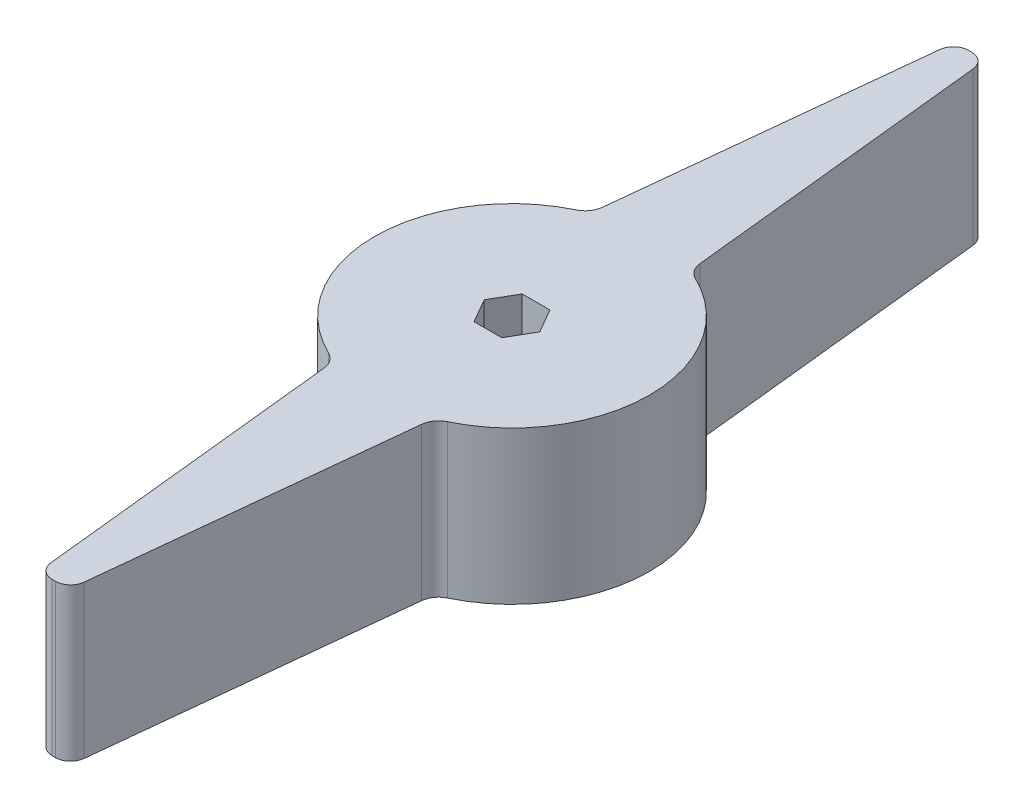
ISO-10303-21;
HEADER;
FILE_DESCRIPTION(('STEP AP214'),'2;1');
FILE_NAME('part.step','',(''),(''),'','','');
FILE_SCHEMA(('AUTOMOTIVE_DESIGN { 1 0 10303 214 1 1 1 1 }'));
ENDSEC;
DATA;
#1=APPLICATION_CONTEXT('core data for automotive mechanical design processes');
#2=APPLICATION_PROTOCOL_DEFINITION('international standard','automotive_design',2000,#1);
#3=PRODUCT_CONTEXT('',#1,'mechanical');
#4=PRODUCT('Part','Part','',(#3));
#5=PRODUCT_RELATED_PRODUCT_CATEGORY('part','',(#4));
#6=PRODUCT_DEFINITION_FORMATION('','',#4);
#7=PRODUCT_DEFINITION_CONTEXT('part definition',#1,'design');
#8=PRODUCT_DEFINITION('design','',#6,#7);
#9=PRODUCT_DEFINITION_SHAPE('','',#8);
#10=(LENGTH_UNIT() NAMED_UNIT(*) SI_UNIT(.MILLI.,.METRE.));
#11=(NAMED_UNIT(*) PLANE_ANGLE_UNIT() SI_UNIT($,.RADIAN.));
#12=(NAMED_UNIT(*) SI_UNIT($,.STERADIAN.) SOLID_ANGLE_UNIT());
#13=UNCERTAINTY_MEASURE_WITH_UNIT(LENGTH_MEASURE(1.E-05),#10,'distance_accuracy_value','');
#14=(GEOMETRIC_REPRESENTATION_CONTEXT(3) GLOBAL_UNCERTAINTY_ASSIGNED_CONTEXT((#13)) GLOBAL_UNIT_ASSIGNED_CONTEXT((#10,
#11,#12)) REPRESENTATION_CONTEXT('',''));
#15=CARTESIAN_POINT('',(0.,0.,0.));
#16=DIRECTION('',(0.,0.,1.));
#17=DIRECTION('',(1.,0.,0.));
#18=AXIS2_PLACEMENT_3D('',#15,#16,#17);
#19=CARTESIAN_POINT('',(0.124283579397994,-41.3802568542113,-36.8297903006777));
#20=DIRECTION('',(0.,1.,0.));
#21=DIRECTION('',(-1.,0.,0.));
#22=AXIS2_PLACEMENT_3D('',#19,#20,#21);
#23=CYLINDRICAL_SURFACE('',#22,1.27);
#24=CARTESIAN_POINT('',(0.124283579397994,-12.7,-36.8297903006777));
#25=DIRECTION('',(0.,-1.,0.));
#26=DIRECTION('',(1.,0.,0.));
#27=AXIS2_PLACEMENT_3D('',#24,#25,#26);
#28=CIRCLE('',#27,1.27);
#29=CARTESIAN_POINT('',(0.128569220066885,-12.7,-38.0997830696666));
#30=VERTEX_POINT('',#29);
#31=CARTESIAN_POINT('',(1.3873263865157,-12.7,-36.9625414490276));
#32=VERTEX_POINT('',#31);
#33=EDGE_CURVE('E11',#30,#32,#28,.T.);
#34=ORIENTED_EDGE('',*,*,#33,.F.);
#35=DIRECTION('',(0.,-1.,0.));
#36=VECTOR('',#35,1.);
#37=CARTESIAN_POINT('',(0.128569220066891,-3.33066907387547E-13,-38.0997830696666));
#38=LINE('',#37,#36);
#39=CARTESIAN_POINT('',(0.128569220066889,0.,-38.0997830696666));
#40=VERTEX_POINT('',#39);
#41=EDGE_CURVE('E24',#40,#30,#38,.T.);
#42=ORIENTED_EDGE('',*,*,#41,.F.);
#43=CARTESIAN_POINT('',(0.124283579397994,0.,-36.8297903006777));
#44=DIRECTION('',(0.,1.,0.));
#45=DIRECTION('',(1.,0.,0.));
#46=AXIS2_PLACEMENT_3D('',#43,#44,#45);
#47=CIRCLE('',#46,1.27);
#48=CARTESIAN_POINT('',(1.3873263865157,0.,-36.9625414490276));
#49=VERTEX_POINT('',#48);
#50=EDGE_CURVE('E432',#49,#40,#47,.T.);
#51=ORIENTED_EDGE('',*,*,#50,.F.);
#52=DIRECTION('',(0.,1.,0.));
#53=VECTOR('',#52,1.);
#54=CARTESIAN_POINT('',(1.3873263865157,0.,-36.9625414490276));
#55=LINE('',#54,#53);
#56=EDGE_CURVE('E427',#32,#49,#55,.T.);
#57=ORIENTED_EDGE('',*,*,#56,.F.);
#58=EDGE_LOOP('',(#34,#42,#51,#57));
#59=FACE_BOUND('',#58,.T.);
#60=ADVANCED_FACE('F16',(#59),#23,.T.);
#61=CARTESIAN_POINT('',(-0.124283579397992,-41.3802568542113,-36.8297903006777));
#62=DIRECTION('',(0.,1.,0.));
#63=DIRECTION('',(-1.,0.,0.));
#64=AXIS2_PLACEMENT_3D('',#61,#62,#63);
#65=CYLINDRICAL_SURFACE('',#64,1.27);
#66=CARTESIAN_POINT('',(-0.124283579397992,-12.7,-36.8297903006777));
#67=DIRECTION('',(0.,-1.,0.));
#68=DIRECTION('',(1.,0.,0.));
#69=AXIS2_PLACEMENT_3D('',#66,#67,#68);
#70=CIRCLE('',#69,1.27);
#71=CARTESIAN_POINT('',(-1.3873263865157,-12.7,-36.9625414490276));
#72=VERTEX_POINT('',#71);
#73=CARTESIAN_POINT('',(-0.128569220066888,-12.7,-38.0997830696666));
#74=VERTEX_POINT('',#73);
#75=EDGE_CURVE('E422',#72,#74,#70,.T.);
#76=ORIENTED_EDGE('',*,*,#75,.F.);
#77=DIRECTION('',(0.,-1.,0.));
#78=VECTOR('',#77,1.);
#79=CARTESIAN_POINT('',(-1.3873263865157,-41.3802568542113,-36.9625414490276));
#80=LINE('',#79,#78);
#81=CARTESIAN_POINT('',(-1.3873263865157,0.,-36.9625414490276));
#82=VERTEX_POINT('',#81);
#83=EDGE_CURVE('E417',#82,#72,#80,.T.);
#84=ORIENTED_EDGE('',*,*,#83,.F.);
#85=CARTESIAN_POINT('',(-0.124283579397992,0.,-36.8297903006777));
#86=DIRECTION('',(0.,1.,0.));
#87=DIRECTION('',(1.,0.,0.));
#88=AXIS2_PLACEMENT_3D('',#85,#86,#87);
#89=CIRCLE('',#88,1.27);
#90=CARTESIAN_POINT('',(-0.128569220066889,0.,-38.0997830696666));
#91=VERTEX_POINT('',#90);
#92=EDGE_CURVE('E414',#91,#82,#89,.T.);
#93=ORIENTED_EDGE('',*,*,#92,.F.);
#94=DIRECTION('',(0.,1.,0.));
#95=VECTOR('',#94,1.);
#96=CARTESIAN_POINT('',(-0.128569220066889,-3.33066907387547E-13,-38.0997830696666));
#97=LINE('',#96,#95);
#98=EDGE_CURVE('E409',#74,#91,#97,.T.);
#99=ORIENTED_EDGE('',*,*,#98,.F.);
#100=EDGE_LOOP('',(#76,#84,#93,#99));
#101=FACE_BOUND('',#100,.T.);
#102=ADVANCED_FACE('F447',(#101),#65,.T.);
#103=CARTESIAN_POINT('',(-5.63513554327944,-12.7,-11.7345879202837));
#104=DIRECTION('',(0.,1.,0.));
#105=DIRECTION('',(-1.,0.,0.));
#106=AXIS2_PLACEMENT_3D('',#103,#104,#105);
#107=CYLINDRICAL_SURFACE('',#106,1.5875);
#108=CARTESIAN_POINT('',(-5.63513554327944,-12.7,-11.7345879202837));
#109=DIRECTION('',(0.,1.,0.));
#110=DIRECTION('',(1.,0.,0.));
#111=AXIS2_PLACEMENT_3D('',#108,#109,#110);
#112=CIRCLE('',#111,1.5875);
#113=CARTESIAN_POINT('',(-4.94792389165999,-12.7,-10.3035406129321));
#114=VERTEX_POINT('',#113);
#115=CARTESIAN_POINT('',(-4.05633203438231,-12.7,-11.5686489848463));
#116=VERTEX_POINT('',#115);
#117=EDGE_CURVE('E404',#114,#116,#112,.T.);
#118=ORIENTED_EDGE('',*,*,#117,.F.);
#119=DIRECTION('',(0.,-1.,0.));
#120=VECTOR('',#119,1.);
#121=CARTESIAN_POINT('',(-4.94792389165999,-12.7,-10.3035406129321));
#122=LINE('',#121,#120);
#123=CARTESIAN_POINT('',(-4.94792389165999,0.,-10.3035406129321));
#124=VERTEX_POINT('',#123);
#125=EDGE_CURVE('E399',#124,#114,#122,.T.);
#126=ORIENTED_EDGE('',*,*,#125,.F.);
#127=CARTESIAN_POINT('',(-5.63513554327944,0.,-11.7345879202837));
#128=DIRECTION('',(0.,-1.,0.));
#129=DIRECTION('',(1.,0.,0.));
#130=AXIS2_PLACEMENT_3D('',#127,#128,#129);
#131=CIRCLE('',#130,1.5875);
#132=CARTESIAN_POINT('',(-4.05633203438231,0.,-11.5686489848463));
#133=VERTEX_POINT('',#132);
#134=EDGE_CURVE('E394',#133,#124,#131,.T.);
#135=ORIENTED_EDGE('',*,*,#134,.F.);
#136=DIRECTION('',(0.,1.,0.));
#137=VECTOR('',#136,1.);
#138=CARTESIAN_POINT('',(-4.05633203438231,0.,-11.5686489848463));
#139=LINE('',#138,#137);
#140=EDGE_CURVE('E389',#116,#133,#139,.T.);
#141=ORIENTED_EDGE('',*,*,#140,.F.);
#142=EDGE_LOOP('',(#118,#126,#135,#141));
#143=FACE_BOUND('',#142,.T.);
#144=ADVANCED_FACE('F487',(#143),#107,.F.);
#145=CARTESIAN_POINT('',(5.63513554327944,-12.7,-11.7345879202837));
#146=DIRECTION('',(0.,1.,0.));
#147=DIRECTION('',(-1.,0.,0.));
#148=AXIS2_PLACEMENT_3D('',#145,#146,#147);
#149=CYLINDRICAL_SURFACE('',#148,1.5875);
#150=CARTESIAN_POINT('',(5.63513554327944,-12.7,-11.7345879202837));
#151=DIRECTION('',(0.,1.,0.));
#152=DIRECTION('',(1.,0.,0.));
#153=AXIS2_PLACEMENT_3D('',#150,#151,#152);
#154=CIRCLE('',#153,1.5875);
#155=CARTESIAN_POINT('',(4.05633203438231,-12.7,-11.5686489848463));
#156=VERTEX_POINT('',#155);
#157=CARTESIAN_POINT('',(4.94792389165999,-12.7,-10.3035406129321));
#158=VERTEX_POINT('',#157);
#159=EDGE_CURVE('E384',#156,#158,#154,.T.);
#160=ORIENTED_EDGE('',*,*,#159,.F.);
#161=DIRECTION('',(0.,-1.,0.));
#162=VECTOR('',#161,1.);
#163=CARTESIAN_POINT('',(4.05633203438231,-41.3802568542113,-11.5686489848463));
#164=LINE('',#163,#162);
#165=CARTESIAN_POINT('',(4.05633203438231,0.,-11.5686489848463));
#166=VERTEX_POINT('',#165);
#167=EDGE_CURVE('E379',#166,#156,#164,.T.);
#168=ORIENTED_EDGE('',*,*,#167,.F.);
#169=CARTESIAN_POINT('',(5.63513554327944,0.,-11.7345879202837));
#170=DIRECTION('',(0.,-1.,0.));
#171=DIRECTION('',(1.,0.,0.));
#172=AXIS2_PLACEMENT_3D('',#169,#170,#171);
#173=CIRCLE('',#172,1.5875);
#174=CARTESIAN_POINT('',(4.94792389165999,0.,-10.3035406129321));
#175=VERTEX_POINT('',#174);
#176=EDGE_CURVE('E374',#175,#166,#173,.T.);
#177=ORIENTED_EDGE('',*,*,#176,.F.);
#178=DIRECTION('',(0.,1.,0.));
#179=VECTOR('',#178,1.);
#180=CARTESIAN_POINT('',(4.94792389165999,-12.7,-10.3035406129321));
#181=LINE('',#180,#179);
#182=EDGE_CURVE('E369',#158,#175,#181,.T.);
#183=ORIENTED_EDGE('',*,*,#182,.F.);
#184=EDGE_LOOP('',(#160,#168,#177,#183));
#185=FACE_BOUND('',#184,.T.);
#186=ADVANCED_FACE('F489',(#185),#149,.F.);
#187=CARTESIAN_POINT('',(-5.2146404262548,-41.3802568542113,-0.548080794186993));
#188=DIRECTION('',(0.994521895368273,0.,0.104528463267654));
#189=DIRECTION('',(-0.104528463267654,0.,0.994521895368273));
#190=AXIS2_PLACEMENT_3D('',#187,#188,#189);
#191=PLANE('',#190);
#192=DIRECTION('',(0.104528463267654,0.,-0.994521895368273));
#193=VECTOR('',#192,1.);
#194=CARTESIAN_POINT('',(-5.2146404262548,0.,-0.548080794186993));
#195=LINE('',#194,#193);
#196=EDGE_CURVE('E364',#133,#82,#195,.T.);
#197=ORIENTED_EDGE('',*,*,#196,.T.);
#198=ORIENTED_EDGE('',*,*,#83,.T.);
#199=DIRECTION('',(0.104528463267654,0.,-0.994521895368273));
#200=VECTOR('',#199,1.);
#201=CARTESIAN_POINT('',(-5.2146404262548,-12.7,-0.548080794186993));
#202=LINE('',#201,#200);
#203=EDGE_CURVE('E361',#116,#72,#202,.T.);
#204=ORIENTED_EDGE('',*,*,#203,.F.);
#205=ORIENTED_EDGE('',*,*,#140,.T.);
#206=EDGE_LOOP('',(#197,#198,#204,#205));
#207=FACE_BOUND('',#206,.T.);
#208=ADVANCED_FACE('F449',(#207),#191,.F.);
#209=CARTESIAN_POINT('',(0.,-41.3802568542113,0.));
#210=DIRECTION('',(0.,1.,0.));
#211=DIRECTION('',(-1.,0.,0.));
#212=AXIS2_PLACEMENT_3D('',#209,#210,#211);
#213=CYLINDRICAL_SURFACE('',#212,38.1);
#214=CARTESIAN_POINT('',(0.,-12.7,0.));
#215=DIRECTION('',(0.,-1.,0.));
#216=DIRECTION('',(1.,0.,0.));
#217=AXIS2_PLACEMENT_3D('',#214,#215,#216);
#218=CIRCLE('',#217,38.1);
#219=EDGE_CURVE('E358',#74,#30,#218,.T.);
#220=ORIENTED_EDGE('',*,*,#219,.F.);
#221=ORIENTED_EDGE('',*,*,#98,.T.);
#222=CARTESIAN_POINT('',(0.,0.,0.));
#223=DIRECTION('',(0.,-1.,0.));
#224=DIRECTION('',(1.,0.,0.));
#225=AXIS2_PLACEMENT_3D('',#222,#223,#224);
#226=CIRCLE('',#225,38.1);
#227=EDGE_CURVE('E354',#91,#40,#226,.T.);
#228=ORIENTED_EDGE('',*,*,#227,.T.);
#229=ORIENTED_EDGE('',*,*,#41,.T.);
#230=EDGE_LOOP('',(#220,#221,#228,#229));
#231=FACE_BOUND('',#230,.T.);
#232=ADVANCED_FACE('F441',(#231),#213,.T.);
#233=CARTESIAN_POINT('',(5.2146404262548,-41.3802568542113,-0.548080794186993));
#234=DIRECTION('',(0.994521895368273,0.,-0.104528463267654));
#235=DIRECTION('',(0.104528463267654,0.,0.994521895368273));
#236=AXIS2_PLACEMENT_3D('',#233,#234,#235);
#237=PLANE('',#236);
#238=DIRECTION('',(-0.104528463267654,0.,-0.994521895368273));
#239=VECTOR('',#238,1.);
#240=CARTESIAN_POINT('',(5.2146404262548,-12.7,-0.548080794186993));
#241=LINE('',#240,#239);
#242=EDGE_CURVE('E349',#156,#32,#241,.T.);
#243=ORIENTED_EDGE('',*,*,#242,.T.);
#244=ORIENTED_EDGE('',*,*,#56,.T.);
#245=DIRECTION('',(-0.104528463267654,0.,-0.994521895368273));
#246=VECTOR('',#245,1.);
#247=CARTESIAN_POINT('',(5.2146404262548,0.,-0.548080794186993));
#248=LINE('',#247,#246);
#249=EDGE_CURVE('E344',#166,#49,#248,.T.);
#250=ORIENTED_EDGE('',*,*,#249,.F.);
#251=ORIENTED_EDGE('',*,*,#167,.T.);
#252=EDGE_LOOP('',(#243,#244,#250,#251));
#253=FACE_BOUND('',#252,.T.);
#254=ADVANCED_FACE('F456',(#253),#237,.T.);
#255=CARTESIAN_POINT('',(-0.124283579397994,-41.3802568542113,36.8297903006777));
#256=DIRECTION('',(0.,1.,0.));
#257=DIRECTION('',(-1.,0.,0.));
#258=AXIS2_PLACEMENT_3D('',#255,#256,#257);
#259=CYLINDRICAL_SURFACE('',#258,1.27);
#260=CARTESIAN_POINT('',(-0.124283579397994,-12.7,36.8297903006777));
#261=DIRECTION('',(0.,-1.,0.));
#262=DIRECTION('',(1.,0.,0.));
#263=AXIS2_PLACEMENT_3D('',#260,#261,#262);
#264=CIRCLE('',#263,1.27);
#265=CARTESIAN_POINT('',(-0.128569220066891,-12.7,38.0997830696666));
#266=VERTEX_POINT('',#265);
#267=CARTESIAN_POINT('',(-1.3873263865157,-12.7,36.9625414490276));
#268=VERTEX_POINT('',#267);
#269=EDGE_CURVE('E339',#266,#268,#264,.T.);
#270=ORIENTED_EDGE('',*,*,#269,.F.);
#271=DIRECTION('',(0.,-1.,0.));
#272=VECTOR('',#271,1.);
#273=CARTESIAN_POINT('',(-0.12856922006689,-41.3802568542113,38.0997830696666));
#274=LINE('',#273,#272);
#275=CARTESIAN_POINT('',(-0.128569220066891,0.,38.0997830696666));
#276=VERTEX_POINT('',#275);
#277=EDGE_CURVE('E334',#276,#266,#274,.T.);
#278=ORIENTED_EDGE('',*,*,#277,.F.);
#279=CARTESIAN_POINT('',(-0.124283579397994,0.,36.8297903006777));
#280=DIRECTION('',(0.,1.,0.));
#281=DIRECTION('',(1.,0.,0.));
#282=AXIS2_PLACEMENT_3D('',#279,#280,#281);
#283=CIRCLE('',#282,1.27);
#284=CARTESIAN_POINT('',(-1.3873263865157,0.,36.9625414490276));
#285=VERTEX_POINT('',#284);
#286=EDGE_CURVE('E329',#285,#276,#283,.T.);
#287=ORIENTED_EDGE('',*,*,#286,.F.);
#288=DIRECTION('',(0.,1.,0.));
#289=VECTOR('',#288,1.);
#290=CARTESIAN_POINT('',(-1.3873263865157,0.,36.9625414490276));
#291=LINE('',#290,#289);
#292=EDGE_CURVE('E324',#268,#285,#291,.T.);
#293=ORIENTED_EDGE('',*,*,#292,.F.);
#294=EDGE_LOOP('',(#270,#278,#287,#293));
#295=FACE_BOUND('',#294,.T.);
#296=ADVANCED_FACE('F475',(#295),#259,.T.);
#297=CARTESIAN_POINT('',(0.124283579397992,-41.3802568542113,36.8297903006777));
#298=DIRECTION('',(0.,1.,0.));
#299=DIRECTION('',(-1.,0.,0.));
#300=AXIS2_PLACEMENT_3D('',#297,#298,#299);
#301=CYLINDRICAL_SURFACE('',#300,1.27);
#302=CARTESIAN_POINT('',(0.124283579397992,-12.7,36.8297903006777));
#303=DIRECTION('',(0.,-1.,0.));
#304=DIRECTION('',(1.,0.,0.));
#305=AXIS2_PLACEMENT_3D('',#302,#303,#304);
#306=CIRCLE('',#305,1.27);
#307=CARTESIAN_POINT('',(1.3873263865157,-12.7,36.9625414490276));
#308=VERTEX_POINT('',#307);
#309=CARTESIAN_POINT('',(0.128569220066889,-12.7,38.0997830696666));
#310=VERTEX_POINT('',#309);
#311=EDGE_CURVE('E319',#308,#310,#306,.T.);
#312=ORIENTED_EDGE('',*,*,#311,.F.);
#313=DIRECTION('',(0.,-1.,0.));
#314=VECTOR('',#313,1.);
#315=CARTESIAN_POINT('',(1.3873263865157,-41.3802568542113,36.9625414490276));
#316=LINE('',#315,#314);
#317=CARTESIAN_POINT('',(1.3873263865157,0.,36.9625414490276));
#318=VERTEX_POINT('',#317);
#319=EDGE_CURVE('E314',#318,#308,#316,.T.);
#320=ORIENTED_EDGE('',*,*,#319,.F.);
#321=CARTESIAN_POINT('',(0.124283579397992,0.,36.8297903006777));
#322=DIRECTION('',(0.,1.,0.));
#323=DIRECTION('',(1.,0.,0.));
#324=AXIS2_PLACEMENT_3D('',#321,#322,#323);
#325=CIRCLE('',#324,1.27);
#326=CARTESIAN_POINT('',(0.128569220066889,0.,38.0997830696666));
#327=VERTEX_POINT('',#326);
#328=EDGE_CURVE('E309',#327,#318,#325,.T.);
#329=ORIENTED_EDGE('',*,*,#328,.F.);
#330=DIRECTION('',(0.,1.,0.));
#331=VECTOR('',#330,1.);
#332=CARTESIAN_POINT('',(0.128569220066889,-41.3802568542113,38.0997830696666));
#333=LINE('',#332,#331);
#334=EDGE_CURVE('E304',#310,#327,#333,.T.);
#335=ORIENTED_EDGE('',*,*,#334,.F.);
#336=EDGE_LOOP('',(#312,#320,#329,#335));
#337=FACE_BOUND('',#336,.T.);
#338=ADVANCED_FACE('F471',(#337),#301,.T.);
#339=CARTESIAN_POINT('',(5.63513554327944,-12.7,11.7345879202837));
#340=DIRECTION('',(0.,1.,0.));
#341=DIRECTION('',(-1.,0.,0.));
#342=AXIS2_PLACEMENT_3D('',#339,#340,#341);
#343=CYLINDRICAL_SURFACE('',#342,1.5875);
#344=CARTESIAN_POINT('',(5.63513554327944,-12.7,11.7345879202837));
#345=DIRECTION('',(0.,1.,0.));
#346=DIRECTION('',(1.,0.,0.));
#347=AXIS2_PLACEMENT_3D('',#344,#345,#346);
#348=CIRCLE('',#347,1.5875);
#349=CARTESIAN_POINT('',(4.94792389165999,-12.7,10.303540612932));
#350=VERTEX_POINT('',#349);
#351=CARTESIAN_POINT('',(4.05633203438231,-12.7,11.5686489848463));
#352=VERTEX_POINT('',#351);
#353=EDGE_CURVE('E299',#350,#352,#348,.T.);
#354=ORIENTED_EDGE('',*,*,#353,.F.);
#355=DIRECTION('',(0.,-1.,0.));
#356=VECTOR('',#355,1.);
#357=CARTESIAN_POINT('',(4.94792389165999,-12.7,10.303540612932));
#358=LINE('',#357,#356);
#359=CARTESIAN_POINT('',(4.94792389165999,0.,10.303540612932));
#360=VERTEX_POINT('',#359);
#361=EDGE_CURVE('E294',#360,#350,#358,.T.);
#362=ORIENTED_EDGE('',*,*,#361,.F.);
#363=CARTESIAN_POINT('',(5.63513554327944,0.,11.7345879202837));
#364=DIRECTION('',(0.,-1.,0.));
#365=DIRECTION('',(1.,0.,0.));
#366=AXIS2_PLACEMENT_3D('',#363,#364,#365);
#367=CIRCLE('',#366,1.5875);
#368=CARTESIAN_POINT('',(4.05633203438231,0.,11.5686489848463));
#369=VERTEX_POINT('',#368);
#370=EDGE_CURVE('E289',#369,#360,#367,.T.);
#371=ORIENTED_EDGE('',*,*,#370,.F.);
#372=DIRECTION('',(0.,1.,0.));
#373=VECTOR('',#372,1.);
#374=CARTESIAN_POINT('',(4.05633203438231,0.,11.5686489848463));
#375=LINE('',#374,#373);
#376=EDGE_CURVE('E284',#352,#369,#375,.T.);
#377=ORIENTED_EDGE('',*,*,#376,.F.);
#378=EDGE_LOOP('',(#354,#362,#371,#377));
#379=FACE_BOUND('',#378,.T.);
#380=ADVANCED_FACE('F463',(#379),#343,.F.);
#381=CARTESIAN_POINT('',(-5.63513554327944,-12.7,11.7345879202837));
#382=DIRECTION('',(0.,1.,0.));
#383=DIRECTION('',(-1.,0.,0.));
#384=AXIS2_PLACEMENT_3D('',#381,#382,#383);
#385=CYLINDRICAL_SURFACE('',#384,1.5875);
#386=CARTESIAN_POINT('',(-5.63513554327944,-12.7,11.7345879202837));
#387=DIRECTION('',(0.,1.,0.));
#388=DIRECTION('',(1.,0.,0.));
#389=AXIS2_PLACEMENT_3D('',#386,#387,#388);
#390=CIRCLE('',#389,1.5875);
#391=CARTESIAN_POINT('',(-4.05633203438231,-12.7,11.5686489848463));
#392=VERTEX_POINT('',#391);
#393=CARTESIAN_POINT('',(-4.94792389166,-12.7,10.303540612932));
#394=VERTEX_POINT('',#393);
#395=EDGE_CURVE('E279',#392,#394,#390,.T.);
#396=ORIENTED_EDGE('',*,*,#395,.F.);
#397=DIRECTION('',(0.,-1.,0.));
#398=VECTOR('',#397,1.);
#399=CARTESIAN_POINT('',(-4.05633203438231,-41.3802568542113,11.5686489848463));
#400=LINE('',#399,#398);
#401=CARTESIAN_POINT('',(-4.05633203438231,0.,11.5686489848463));
#402=VERTEX_POINT('',#401);
#403=EDGE_CURVE('E274',#402,#392,#400,.T.);
#404=ORIENTED_EDGE('',*,*,#403,.F.);
#405=CARTESIAN_POINT('',(-5.63513554327944,0.,11.7345879202837));
#406=DIRECTION('',(0.,-1.,0.));
#407=DIRECTION('',(1.,0.,0.));
#408=AXIS2_PLACEMENT_3D('',#405,#406,#407);
#409=CIRCLE('',#408,1.5875);
#410=CARTESIAN_POINT('',(-4.94792389166,0.,10.303540612932));
#411=VERTEX_POINT('',#410);
#412=EDGE_CURVE('E269',#411,#402,#409,.T.);
#413=ORIENTED_EDGE('',*,*,#412,.F.);
#414=DIRECTION('',(0.,1.,0.));
#415=VECTOR('',#414,1.);
#416=CARTESIAN_POINT('',(-4.94792389166,-12.7,10.303540612932));
#417=LINE('',#416,#415);
#418=EDGE_CURVE('E264',#394,#411,#417,.T.);
#419=ORIENTED_EDGE('',*,*,#418,.F.);
#420=EDGE_LOOP('',(#396,#404,#413,#419));
#421=FACE_BOUND('',#420,.T.);
#422=ADVANCED_FACE('F482',(#421),#385,.F.);
#423=CARTESIAN_POINT('',(5.2146404262548,-41.3802568542113,0.548080794186993));
#424=DIRECTION('',(-0.994521895368273,0.,-0.104528463267654));
#425=DIRECTION('',(0.104528463267654,0.,-0.994521895368273));
#426=AXIS2_PLACEMENT_3D('',#423,#424,#425);
#427=PLANE('',#426);
#428=DIRECTION('',(-0.104528463267654,0.,0.994521895368273));
#429=VECTOR('',#428,1.);
#430=CARTESIAN_POINT('',(5.2146404262548,0.,0.548080794186993));
#431=LINE('',#430,#429);
#432=EDGE_CURVE('E259',#369,#318,#431,.T.);
#433=ORIENTED_EDGE('',*,*,#432,.T.);
#434=ORIENTED_EDGE('',*,*,#319,.T.);
#435=DIRECTION('',(-0.104528463267654,0.,0.994521895368273));
#436=VECTOR('',#435,1.);
#437=CARTESIAN_POINT('',(5.2146404262548,-12.7,0.548080794186993));
#438=LINE('',#437,#436);
#439=EDGE_CURVE('E254',#352,#308,#438,.T.);
#440=ORIENTED_EDGE('',*,*,#439,.F.);
#441=ORIENTED_EDGE('',*,*,#376,.T.);
#442=EDGE_LOOP('',(#433,#434,#440,#441));
#443=FACE_BOUND('',#442,.T.);
#444=ADVANCED_FACE('F467',(#443),#427,.F.);
#445=CARTESIAN_POINT('',(0.,-12.7,0.));
#446=DIRECTION('',(0.,-1.,0.));
#447=DIRECTION('',(1.,0.,0.));
#448=AXIS2_PLACEMENT_3D('',#445,#446,#447);
#449=CIRCLE('',#448,38.1);
#450=EDGE_CURVE('E249',#310,#266,#449,.T.);
#451=ORIENTED_EDGE('',*,*,#450,.F.);
#452=ORIENTED_EDGE('',*,*,#334,.T.);
#453=CARTESIAN_POINT('',(0.,0.,0.));
#454=DIRECTION('',(0.,-1.,0.));
#455=DIRECTION('',(1.,0.,0.));
#456=AXIS2_PLACEMENT_3D('',#453,#454,#455);
#457=CIRCLE('',#456,38.1);
#458=EDGE_CURVE('E244',#327,#276,#457,.T.);
#459=ORIENTED_EDGE('',*,*,#458,.T.);
#460=ORIENTED_EDGE('',*,*,#277,.T.);
#461=EDGE_LOOP('',(#451,#452,#459,#460));
#462=FACE_BOUND('',#461,.T.);
#463=ADVANCED_FACE('F473',(#462),#213,.T.);
#464=CARTESIAN_POINT('',(-5.2146404262548,-41.3802568542113,0.548080794186993));
#465=DIRECTION('',(-0.994521895368273,0.,0.104528463267654));
#466=DIRECTION('',(-0.104528463267654,0.,-0.994521895368273));
#467=AXIS2_PLACEMENT_3D('',#464,#465,#466);
#468=PLANE('',#467);
#469=DIRECTION('',(0.104528463267654,0.,0.994521895368273));
#470=VECTOR('',#469,1.);
#471=CARTESIAN_POINT('',(-5.2146404262548,-12.7,0.548080794186993));
#472=LINE('',#471,#470);
#473=EDGE_CURVE('E239',#392,#268,#472,.T.);
#474=ORIENTED_EDGE('',*,*,#473,.T.);
#475=ORIENTED_EDGE('',*,*,#292,.T.);
#476=DIRECTION('',(0.104528463267654,0.,0.994521895368273));
#477=VECTOR('',#476,1.);
#478=CARTESIAN_POINT('',(-5.2146404262548,0.,0.548080794186993));
#479=LINE('',#478,#477);
#480=EDGE_CURVE('E234',#402,#285,#479,.T.);
#481=ORIENTED_EDGE('',*,*,#480,.F.);
#482=ORIENTED_EDGE('',*,*,#403,.T.);
#483=EDGE_LOOP('',(#474,#475,#481,#482));
#484=FACE_BOUND('',#483,.T.);
#485=ADVANCED_FACE('F479',(#484),#468,.T.);
#486=CARTESIAN_POINT('',(0.,0.,0.));
#487=DIRECTION('',(0.,-1.,0.));
#488=DIRECTION('',(1.,0.,0.));
#489=AXIS2_PLACEMENT_3D('',#486,#487,#488);
#490=PLANE('',#489);
#491=ORIENTED_EDGE('',*,*,#227,.F.);
#492=ORIENTED_EDGE('',*,*,#92,.T.);
#493=ORIENTED_EDGE('',*,*,#196,.F.);
#494=ORIENTED_EDGE('',*,*,#134,.T.);
#495=CARTESIAN_POINT('',(0.,0.,0.));
#496=DIRECTION('',(0.,-1.,0.));
#497=DIRECTION('',(1.,0.,0.));
#498=AXIS2_PLACEMENT_3D('',#495,#496,#497);
#499=CIRCLE('',#498,11.43);
#500=EDGE_CURVE('E229',#411,#124,#499,.T.);
#501=ORIENTED_EDGE('',*,*,#500,.F.);
#502=ORIENTED_EDGE('',*,*,#412,.T.);
#503=ORIENTED_EDGE('',*,*,#480,.T.);
#504=ORIENTED_EDGE('',*,*,#286,.T.);
#505=ORIENTED_EDGE('',*,*,#458,.F.);
#506=ORIENTED_EDGE('',*,*,#328,.T.);
#507=ORIENTED_EDGE('',*,*,#432,.F.);
#508=ORIENTED_EDGE('',*,*,#370,.T.);
#509=CARTESIAN_POINT('',(0.,0.,0.));
#510=DIRECTION('',(0.,-1.,0.));
#511=DIRECTION('',(1.,0.,0.));
#512=AXIS2_PLACEMENT_3D('',#509,#510,#511);
#513=CIRCLE('',#512,11.43);
#514=EDGE_CURVE('E224',#175,#360,#513,.T.);
#515=ORIENTED_EDGE('',*,*,#514,.F.);
#516=ORIENTED_EDGE('',*,*,#176,.T.);
#517=ORIENTED_EDGE('',*,*,#249,.T.);
#518=ORIENTED_EDGE('',*,*,#50,.T.);
#519=EDGE_LOOP('',(#491,#492,#493,#494,#501,#502,#503,#504,#505,#506,#507,#508,#515,#516,#517,#518));
#520=FACE_BOUND('',#519,.T.);
#521=DIRECTION('',(0.5,0.,0.866025403784439));
#522=VECTOR('',#521,1.);
#523=CARTESIAN_POINT('',(1.73205080756888,0.,-1.));
#524=LINE('',#523,#522);
#525=CARTESIAN_POINT('',(1.15470053837925,0.,-2.));
#526=VERTEX_POINT('',#525);
#527=CARTESIAN_POINT('',(2.3094010767585,0.,0.));
#528=VERTEX_POINT('',#527);
#529=EDGE_CURVE('E220',#526,#528,#524,.T.);
#530=ORIENTED_EDGE('',*,*,#529,.T.);
#531=DIRECTION('',(-0.5,0.,0.866025403784439));
#532=VECTOR('',#531,1.);
#533=CARTESIAN_POINT('',(1.73205080756887,0.,1.));
#534=LINE('',#533,#532);
#535=CARTESIAN_POINT('',(1.15470053837925,0.,2.));
#536=VERTEX_POINT('',#535);
#537=EDGE_CURVE('E175',#528,#536,#534,.T.);
#538=ORIENTED_EDGE('',*,*,#537,.T.);
#539=DIRECTION('',(-1.,0.,0.));
#540=VECTOR('',#539,1.);
#541=CARTESIAN_POINT('',(0.,0.,2.));
#542=LINE('',#541,#540);
#543=CARTESIAN_POINT('',(-1.15470053837925,0.,2.));
#544=VERTEX_POINT('',#543);
#545=EDGE_CURVE('E213',#536,#544,#542,.T.);
#546=ORIENTED_EDGE('',*,*,#545,.T.);
#547=DIRECTION('',(-0.5,0.,-0.866025403784439));
#548=VECTOR('',#547,1.);
#549=CARTESIAN_POINT('',(-1.73205080756887,0.,1.));
#550=LINE('',#549,#548);
#551=CARTESIAN_POINT('',(-2.3094010767585,0.,0.));
#552=VERTEX_POINT('',#551);
#553=EDGE_CURVE('E209',#544,#552,#550,.T.);
#554=ORIENTED_EDGE('',*,*,#553,.T.);
#555=DIRECTION('',(0.5,0.,-0.866025403784439));
#556=VECTOR('',#555,1.);
#557=CARTESIAN_POINT('',(-1.73205080756888,0.,-1.));
#558=LINE('',#557,#556);
#559=CARTESIAN_POINT('',(-1.15470053837925,0.,-2.));
#560=VERTEX_POINT('',#559);
#561=EDGE_CURVE('E205',#552,#560,#558,.T.);
#562=ORIENTED_EDGE('',*,*,#561,.T.);
#563=DIRECTION('',(1.,0.,0.));
#564=VECTOR('',#563,1.);
#565=CARTESIAN_POINT('',(0.,0.,-2.));
#566=LINE('',#565,#564);
#567=EDGE_CURVE('E201',#560,#526,#566,.T.);
#568=ORIENTED_EDGE('',*,*,#567,.T.);
#569=EDGE_LOOP('',(#530,#538,#546,#554,#562,#568));
#570=FACE_BOUND('',#569,.T.);
#571=ADVANCED_FACE('F452',(#520,#570),#490,.F.);
#572=CARTESIAN_POINT('',(0.,-12.7,0.));
#573=DIRECTION('',(0.,-1.,0.));
#574=DIRECTION('',(1.,0.,0.));
#575=AXIS2_PLACEMENT_3D('',#572,#573,#574);
#576=PLANE('',#575);
#577=ORIENTED_EDGE('',*,*,#203,.T.);
#578=ORIENTED_EDGE('',*,*,#75,.T.);
#579=ORIENTED_EDGE('',*,*,#219,.T.);
#580=ORIENTED_EDGE('',*,*,#33,.T.);
#581=ORIENTED_EDGE('',*,*,#242,.F.);
#582=ORIENTED_EDGE('',*,*,#159,.T.);
#583=CARTESIAN_POINT('',(0.,-12.7,0.));
#584=DIRECTION('',(0.,-1.,0.));
#585=DIRECTION('',(1.,0.,0.));
#586=AXIS2_PLACEMENT_3D('',#583,#584,#585);
#587=CIRCLE('',#586,11.43);
#588=EDGE_CURVE('E188',#158,#350,#587,.T.);
#589=ORIENTED_EDGE('',*,*,#588,.T.);
#590=ORIENTED_EDGE('',*,*,#353,.T.);
#591=ORIENTED_EDGE('',*,*,#439,.T.);
#592=ORIENTED_EDGE('',*,*,#311,.T.);
#593=ORIENTED_EDGE('',*,*,#450,.T.);
#594=ORIENTED_EDGE('',*,*,#269,.T.);
#595=ORIENTED_EDGE('',*,*,#473,.F.);
#596=ORIENTED_EDGE('',*,*,#395,.T.);
#597=CARTESIAN_POINT('',(0.,-12.7,0.));
#598=DIRECTION('',(0.,-1.,0.));
#599=DIRECTION('',(1.,0.,0.));
#600=AXIS2_PLACEMENT_3D('',#597,#598,#599);
#601=CIRCLE('',#600,11.43);
#602=EDGE_CURVE('E184',#394,#114,#601,.T.);
#603=ORIENTED_EDGE('',*,*,#602,.T.);
#604=ORIENTED_EDGE('',*,*,#117,.T.);
#605=EDGE_LOOP('',(#577,#578,#579,#580,#581,#582,#589,#590,#591,#592,#593,#594,#595,#596,#603,#604));
#606=FACE_BOUND('',#605,.T.);
#607=DIRECTION('',(0.5,0.,0.866025403784439));
#608=VECTOR('',#607,1.);
#609=CARTESIAN_POINT('',(1.73205080756888,-12.7,-1.));
#610=LINE('',#609,#608);
#611=CARTESIAN_POINT('',(1.15470053837925,-12.7,-2.));
#612=VERTEX_POINT('',#611);
#613=CARTESIAN_POINT('',(2.3094010767585,-12.7,0.));
#614=VERTEX_POINT('',#613);
#615=EDGE_CURVE('E163',#612,#614,#610,.T.);
#616=ORIENTED_EDGE('',*,*,#615,.F.);
#617=DIRECTION('',(1.,0.,0.));
#618=VECTOR('',#617,1.);
#619=CARTESIAN_POINT('',(0.,-12.7,-2.));
#620=LINE('',#619,#618);
#621=CARTESIAN_POINT('',(-1.15470053837925,-12.7,-2.));
#622=VERTEX_POINT('',#621);
#623=EDGE_CURVE('E185',#622,#612,#620,.T.);
#624=ORIENTED_EDGE('',*,*,#623,.F.);
#625=DIRECTION('',(0.5,0.,-0.866025403784439));
#626=VECTOR('',#625,1.);
#627=CARTESIAN_POINT('',(-1.73205080756888,-12.7,-1.));
#628=LINE('',#627,#626);
#629=CARTESIAN_POINT('',(-2.3094010767585,-12.7,0.));
#630=VERTEX_POINT('',#629);
#631=EDGE_CURVE('E190',#630,#622,#628,.T.);
#632=ORIENTED_EDGE('',*,*,#631,.F.);
#633=DIRECTION('',(-0.5,0.,-0.866025403784439));
#634=VECTOR('',#633,1.);
#635=CARTESIAN_POINT('',(-1.73205080756887,-12.7,1.));
#636=LINE('',#635,#634);
#637=CARTESIAN_POINT('',(-1.15470053837925,-12.7,2.));
#638=VERTEX_POINT('',#637);
#639=EDGE_CURVE('E727',#638,#630,#636,.T.);
#640=ORIENTED_EDGE('',*,*,#639,.F.);
#641=DIRECTION('',(-1.,0.,0.));
#642=VECTOR('',#641,1.);
#643=CARTESIAN_POINT('',(0.,-12.7,2.));
#644=LINE('',#643,#642);
#645=CARTESIAN_POINT('',(1.15470053837925,-12.7,2.));
#646=VERTEX_POINT('',#645);
#647=EDGE_CURVE('E166',#646,#638,#644,.T.);
#648=ORIENTED_EDGE('',*,*,#647,.F.);
#649=DIRECTION('',(-0.5,0.,0.866025403784439));
#650=VECTOR('',#649,1.);
#651=CARTESIAN_POINT('',(1.73205080756887,-12.7,1.));
#652=LINE('',#651,#650);
#653=EDGE_CURVE('E159',#614,#646,#652,.T.);
#654=ORIENTED_EDGE('',*,*,#653,.F.);
#655=EDGE_LOOP('',(#616,#624,#632,#640,#648,#654));
#656=FACE_BOUND('',#655,.T.);
#657=ADVANCED_FACE('F161',(#606,#656),#576,.T.);
#658=CARTESIAN_POINT('',(0.,-12.7,0.));
#659=DIRECTION('',(0.,1.,0.));
#660=DIRECTION('',(-1.,0.,0.));
#661=AXIS2_PLACEMENT_3D('',#658,#659,#660);
#662=CYLINDRICAL_SURFACE('',#661,11.43);
#663=ORIENTED_EDGE('',*,*,#588,.F.);
#664=ORIENTED_EDGE('',*,*,#182,.T.);
#665=ORIENTED_EDGE('',*,*,#514,.T.);
#666=ORIENTED_EDGE('',*,*,#361,.T.);
#667=EDGE_LOOP('',(#663,#664,#665,#666));
#668=FACE_BOUND('',#667,.T.);
#669=ADVANCED_FACE('F460',(#668),#662,.T.);
#670=CARTESIAN_POINT('',(1.73205080756887,-12.7,1.));
#671=DIRECTION('',(-0.866025403784439,0.,-0.5));
#672=DIRECTION('',(0.5,0.,-0.866025403784439));
#673=AXIS2_PLACEMENT_3D('',#670,#671,#672);
#674=PLANE('',#673);
#675=ORIENTED_EDGE('',*,*,#537,.F.);
#676=DIRECTION('',(0.,1.,0.));
#677=VECTOR('',#676,1.);
#678=CARTESIAN_POINT('',(2.3094010767585,-12.7,0.));
#679=LINE('',#678,#677);
#680=EDGE_CURVE('E170',#614,#528,#679,.T.);
#681=ORIENTED_EDGE('',*,*,#680,.F.);
#682=ORIENTED_EDGE('',*,*,#653,.T.);
#683=DIRECTION('',(0.,1.,0.));
#684=VECTOR('',#683,1.);
#685=CARTESIAN_POINT('',(1.15470053837925,-12.7,2.));
#686=LINE('',#685,#684);
#687=EDGE_CURVE('E178',#646,#536,#686,.T.);
#688=ORIENTED_EDGE('',*,*,#687,.T.);
#689=EDGE_LOOP('',(#675,#681,#682,#688));
#690=FACE_BOUND('',#689,.T.);
#691=ADVANCED_FACE('F174',(#690),#674,.T.);
#692=CARTESIAN_POINT('',(0.,-12.7,2.));
#693=DIRECTION('',(0.,0.,-1.));
#694=DIRECTION('',(0.,1.,0.));
#695=AXIS2_PLACEMENT_3D('',#692,#693,#694);
#696=PLANE('',#695);
#697=ORIENTED_EDGE('',*,*,#545,.F.);
#698=ORIENTED_EDGE('',*,*,#687,.F.);
#699=ORIENTED_EDGE('',*,*,#647,.T.);
#700=DIRECTION('',(0.,1.,0.));
#701=VECTOR('',#700,1.);
#702=CARTESIAN_POINT('',(-1.15470053837925,-12.7,2.));
#703=LINE('',#702,#701);
#704=EDGE_CURVE('E705',#638,#544,#703,.T.);
#705=ORIENTED_EDGE('',*,*,#704,.T.);
#706=EDGE_LOOP('',(#697,#698,#699,#705));
#707=FACE_BOUND('',#706,.T.);
#708=ADVANCED_FACE('F634',(#707),#696,.T.);
#709=CARTESIAN_POINT('',(-1.73205080756887,-12.7,1.));
#710=DIRECTION('',(0.866025403784439,0.,-0.5));
#711=DIRECTION('',(0.5,0.,0.866025403784439));
#712=AXIS2_PLACEMENT_3D('',#709,#710,#711);
#713=PLANE('',#712);
#714=ORIENTED_EDGE('',*,*,#553,.F.);
#715=ORIENTED_EDGE('',*,*,#704,.F.);
#716=ORIENTED_EDGE('',*,*,#639,.T.);
#717=DIRECTION('',(0.,1.,0.));
#718=VECTOR('',#717,1.);
#719=CARTESIAN_POINT('',(-2.3094010767585,-12.7,0.));
#720=LINE('',#719,#718);
#721=EDGE_CURVE('E703',#630,#552,#720,.T.);
#722=ORIENTED_EDGE('',*,*,#721,.T.);
#723=EDGE_LOOP('',(#714,#715,#716,#722));
#724=FACE_BOUND('',#723,.T.);
#725=ADVANCED_FACE('F643',(#724),#713,.T.);
#726=CARTESIAN_POINT('',(-1.73205080756888,-12.7,-1.));
#727=DIRECTION('',(0.866025403784439,0.,0.5));
#728=DIRECTION('',(-0.5,0.,0.866025403784439));
#729=AXIS2_PLACEMENT_3D('',#726,#727,#728);
#730=PLANE('',#729);
#731=ORIENTED_EDGE('',*,*,#561,.F.);
#732=ORIENTED_EDGE('',*,*,#721,.F.);
#733=ORIENTED_EDGE('',*,*,#631,.T.);
#734=DIRECTION('',(0.,1.,0.));
#735=VECTOR('',#734,1.);
#736=CARTESIAN_POINT('',(-1.15470053837925,-12.7,-2.));
#737=LINE('',#736,#735);
#738=EDGE_CURVE('E697',#622,#560,#737,.T.);
#739=ORIENTED_EDGE('',*,*,#738,.T.);
#740=EDGE_LOOP('',(#731,#732,#733,#739));
#741=FACE_BOUND('',#740,.T.);
#742=ADVANCED_FACE('F653',(#741),#730,.T.);
#743=CARTESIAN_POINT('',(0.,-12.7,-2.));
#744=DIRECTION('',(0.,0.,1.));
#745=DIRECTION('',(-1.,0.,0.));
#746=AXIS2_PLACEMENT_3D('',#743,#744,#745);
#747=PLANE('',#746);
#748=ORIENTED_EDGE('',*,*,#567,.F.);
#749=ORIENTED_EDGE('',*,*,#738,.F.);
#750=ORIENTED_EDGE('',*,*,#623,.T.);
#751=DIRECTION('',(0.,1.,0.));
#752=VECTOR('',#751,1.);
#753=CARTESIAN_POINT('',(1.15470053837925,-12.7,-2.));
#754=LINE('',#753,#752);
#755=EDGE_CURVE('E183',#612,#526,#754,.T.);
#756=ORIENTED_EDGE('',*,*,#755,.T.);
#757=EDGE_LOOP('',(#748,#749,#750,#756));
#758=FACE_BOUND('',#757,.T.);
#759=ADVANCED_FACE('F663',(#758),#747,.T.);
#760=CARTESIAN_POINT('',(1.73205080756888,-12.7,-1.));
#761=DIRECTION('',(-0.866025403784439,0.,0.5));
#762=DIRECTION('',(-0.5,0.,-0.866025403784439));
#763=AXIS2_PLACEMENT_3D('',#760,#761,#762);
#764=PLANE('',#763);
#765=ORIENTED_EDGE('',*,*,#529,.F.);
#766=ORIENTED_EDGE('',*,*,#755,.F.);
#767=ORIENTED_EDGE('',*,*,#615,.T.);
#768=ORIENTED_EDGE('',*,*,#680,.T.);
#769=EDGE_LOOP('',(#765,#766,#767,#768));
#770=FACE_BOUND('',#769,.T.);
#771=ADVANCED_FACE('F181',(#770),#764,.T.);
#772=ORIENTED_EDGE('',*,*,#602,.F.);
#773=ORIENTED_EDGE('',*,*,#418,.T.);
#774=ORIENTED_EDGE('',*,*,#500,.T.);
#775=ORIENTED_EDGE('',*,*,#125,.T.);
#776=EDGE_LOOP('',(#772,#773,#774,#775));
#777=FACE_BOUND('',#776,.T.);
#778=ADVANCED_FACE('F485',(#777),#662,.T.);
#779=CLOSED_SHELL('',(#60,#102,#144,#186,#208,#232,#254,#296,#338,#380,#422,#444,#463,#485,#571,
#657,#669,#691,#708,#725,#742,#759,#771,#778));
#780=MANIFOLD_SOLID_BREP('B1',#779);
#781=ADVANCED_BREP_SHAPE_REPRESENTATION('',(#18,#780),#14);
#782=SHAPE_DEFINITION_REPRESENTATION(#9,#781);
ENDSEC;
END-ISO-10303-21;
